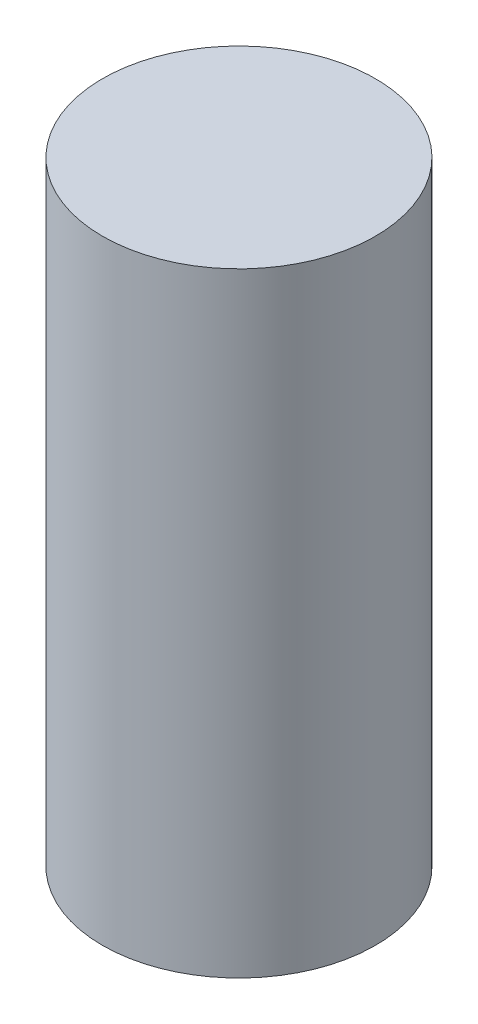
ISO-10303-21;
HEADER;
FILE_DESCRIPTION(('STEP AP214'),'2;1');
FILE_NAME('part.step','',(''),(''),'','','');
FILE_SCHEMA(('AUTOMOTIVE_DESIGN { 1 0 10303 214 1 1 1 1 }'));
ENDSEC;
DATA;
#1=APPLICATION_CONTEXT('core data for automotive mechanical design processes');
#2=APPLICATION_PROTOCOL_DEFINITION('international standard','automotive_design',2000,#1);
#3=PRODUCT_CONTEXT('',#1,'mechanical');
#4=PRODUCT('Part','Part','',(#3));
#5=PRODUCT_RELATED_PRODUCT_CATEGORY('part','',(#4));
#6=PRODUCT_DEFINITION_FORMATION('','',#4);
#7=PRODUCT_DEFINITION_CONTEXT('part definition',#1,'design');
#8=PRODUCT_DEFINITION('design','',#6,#7);
#9=PRODUCT_DEFINITION_SHAPE('','',#8);
#10=(LENGTH_UNIT() NAMED_UNIT(*) SI_UNIT(.MILLI.,.METRE.));
#11=(NAMED_UNIT(*) PLANE_ANGLE_UNIT() SI_UNIT($,.RADIAN.));
#12=(NAMED_UNIT(*) SI_UNIT($,.STERADIAN.) SOLID_ANGLE_UNIT());
#13=UNCERTAINTY_MEASURE_WITH_UNIT(LENGTH_MEASURE(1.E-05),#10,'distance_accuracy_value','');
#14=(GEOMETRIC_REPRESENTATION_CONTEXT(3) GLOBAL_UNCERTAINTY_ASSIGNED_CONTEXT((#13)) GLOBAL_UNIT_ASSIGNED_CONTEXT((#10,
#11,#12)) REPRESENTATION_CONTEXT('',''));
#15=CARTESIAN_POINT('',(0.,0.,0.));
#16=DIRECTION('',(0.,0.,1.));
#17=DIRECTION('',(1.,0.,0.));
#18=AXIS2_PLACEMENT_3D('',#15,#16,#17);
#19=CARTESIAN_POINT('',(0.,45.,0.));
#20=DIRECTION('',(0.,-1.,0.));
#21=DIRECTION('',(0.,0.,-1.));
#22=AXIS2_PLACEMENT_3D('',#19,#20,#21);
#23=CYLINDRICAL_SURFACE('',#22,10.);
#24=CARTESIAN_POINT('',(0.,45.,0.));
#25=DIRECTION('',(0.,1.,0.));
#26=DIRECTION('',(0.,0.,1.));
#27=AXIS2_PLACEMENT_3D('',#24,#25,#26);
#28=CIRCLE('',#27,10.);
#29=CARTESIAN_POINT('',(0.,45.,10.));
#30=VERTEX_POINT('',#29);
#31=EDGE_CURVE('E10',#30,#30,#28,.T.);
#32=ORIENTED_EDGE('',*,*,#31,.F.);
#33=EDGE_LOOP('',(#32));
#34=FACE_BOUND('',#33,.T.);
#35=CARTESIAN_POINT('',(0.,0.,0.));
#36=DIRECTION('',(0.,1.,0.));
#37=DIRECTION('',(0.,0.,1.));
#38=AXIS2_PLACEMENT_3D('',#35,#36,#37);
#39=CIRCLE('',#38,10.);
#40=CARTESIAN_POINT('',(0.,0.,10.));
#41=VERTEX_POINT('',#40);
#42=EDGE_CURVE('E34',#41,#41,#39,.T.);
#43=ORIENTED_EDGE('',*,*,#42,.T.);
#44=EDGE_LOOP('',(#43));
#45=FACE_BOUND('',#44,.T.);
#46=ADVANCED_FACE('F31',(#34,#45),#23,.T.);
#47=CARTESIAN_POINT('',(0.,45.,0.));
#48=DIRECTION('',(0.,1.,0.));
#49=DIRECTION('',(0.,0.,1.));
#50=AXIS2_PLACEMENT_3D('',#47,#48,#49);
#51=PLANE('',#50);
#52=ORIENTED_EDGE('',*,*,#31,.T.);
#53=EDGE_LOOP('',(#52));
#54=FACE_BOUND('',#53,.T.);
#55=ADVANCED_FACE('F46',(#54),#51,.T.);
#56=CARTESIAN_POINT('',(0.,0.,0.));
#57=DIRECTION('',(0.,1.,0.));
#58=DIRECTION('',(0.,0.,1.));
#59=AXIS2_PLACEMENT_3D('',#56,#57,#58);
#60=PLANE('',#59);
#61=ORIENTED_EDGE('',*,*,#42,.F.);
#62=EDGE_LOOP('',(#61));
#63=FACE_BOUND('',#62,.T.);
#64=ADVANCED_FACE('F44',(#63),#60,.F.);
#65=CLOSED_SHELL('',(#46,#55,#64));
#66=MANIFOLD_SOLID_BREP('B2',#65);
#67=ADVANCED_BREP_SHAPE_REPRESENTATION('',(#18,#66),#14);
#68=SHAPE_DEFINITION_REPRESENTATION(#9,#67);
ENDSEC;
END-ISO-10303-21;
